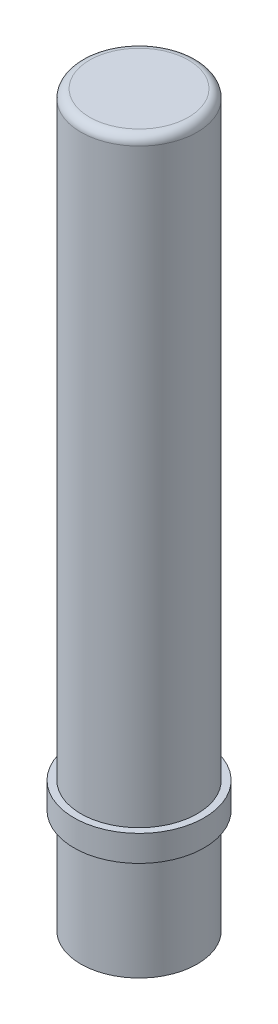
ISO-10303-21;
HEADER;
FILE_DESCRIPTION(('STEP AP214'),'2;1');
FILE_NAME('part.step','',(''),(''),'','','');
FILE_SCHEMA(('AUTOMOTIVE_DESIGN { 1 0 10303 214 1 1 1 1 }'));
ENDSEC;
DATA;
#1=APPLICATION_CONTEXT('core data for automotive mechanical design processes');
#2=APPLICATION_PROTOCOL_DEFINITION('international standard','automotive_design',2000,#1);
#3=PRODUCT_CONTEXT('',#1,'mechanical');
#4=PRODUCT('Part','Part','',(#3));
#5=PRODUCT_RELATED_PRODUCT_CATEGORY('part','',(#4));
#6=PRODUCT_DEFINITION_FORMATION('','',#4);
#7=PRODUCT_DEFINITION_CONTEXT('part definition',#1,'design');
#8=PRODUCT_DEFINITION('design','',#6,#7);
#9=PRODUCT_DEFINITION_SHAPE('','',#8);
#10=(LENGTH_UNIT() NAMED_UNIT(*) SI_UNIT(.MILLI.,.METRE.));
#11=(NAMED_UNIT(*) PLANE_ANGLE_UNIT() SI_UNIT($,.RADIAN.));
#12=(NAMED_UNIT(*) SI_UNIT($,.STERADIAN.) SOLID_ANGLE_UNIT());
#13=UNCERTAINTY_MEASURE_WITH_UNIT(LENGTH_MEASURE(1.E-05),#10,'distance_accuracy_value','');
#14=(GEOMETRIC_REPRESENTATION_CONTEXT(3) GLOBAL_UNCERTAINTY_ASSIGNED_CONTEXT((#13)) GLOBAL_UNIT_ASSIGNED_CONTEXT((#10,
#11,#12)) REPRESENTATION_CONTEXT('',''));
#15=CARTESIAN_POINT('',(0.,0.,0.));
#16=DIRECTION('',(0.,0.,1.));
#17=DIRECTION('',(1.,0.,0.));
#18=AXIS2_PLACEMENT_3D('',#15,#16,#17);
#19=CARTESIAN_POINT('',(0.,42.,0.));
#20=DIRECTION('',(0.,-1.,0.));
#21=DIRECTION('',(0.,0.,-1.));
#22=AXIS2_PLACEMENT_3D('',#19,#20,#21);
#23=CYLINDRICAL_SURFACE('',#22,3.35);
#24=CARTESIAN_POINT('',(0.,41.5,0.));
#25=DIRECTION('',(0.,1.,0.));
#26=DIRECTION('',(0.,0.,1.));
#27=AXIS2_PLACEMENT_3D('',#24,#25,#26);
#28=CIRCLE('',#27,3.35);
#29=CARTESIAN_POINT('',(0.,41.5,3.35));
#30=VERTEX_POINT('',#29);
#31=EDGE_CURVE('E10',#30,#30,#28,.F.);
#32=ORIENTED_EDGE('',*,*,#31,.T.);
#33=EDGE_LOOP('',(#32));
#34=FACE_BOUND('',#33,.T.);
#35=CARTESIAN_POINT('',(0.,7.5,0.));
#36=DIRECTION('',(0.,-1.,0.));
#37=DIRECTION('',(0.,0.,-1.));
#38=AXIS2_PLACEMENT_3D('',#35,#36,#37);
#39=CIRCLE('',#38,3.35);
#40=CARTESIAN_POINT('',(0.,7.5,-3.35));
#41=VERTEX_POINT('',#40);
#42=EDGE_CURVE('E46',#41,#41,#39,.T.);
#43=ORIENTED_EDGE('',*,*,#42,.F.);
#44=EDGE_LOOP('',(#43));
#45=FACE_BOUND('',#44,.T.);
#46=ADVANCED_FACE('F35',(#34,#45),#23,.T.);
#47=CARTESIAN_POINT('',(0.,42.,0.));
#48=DIRECTION('',(0.,1.,0.));
#49=DIRECTION('',(0.,0.,1.));
#50=AXIS2_PLACEMENT_3D('',#47,#48,#49);
#51=PLANE('',#50);
#52=CARTESIAN_POINT('',(0.,42.,0.));
#53=DIRECTION('',(0.,1.,0.));
#54=DIRECTION('',(0.,0.,1.));
#55=AXIS2_PLACEMENT_3D('',#52,#53,#54);
#56=CIRCLE('',#55,2.85);
#57=CARTESIAN_POINT('',(0.,42.,2.85));
#58=VERTEX_POINT('',#57);
#59=EDGE_CURVE('E42',#58,#58,#56,.T.);
#60=ORIENTED_EDGE('',*,*,#59,.T.);
#61=EDGE_LOOP('',(#60));
#62=FACE_BOUND('',#61,.T.);
#63=ADVANCED_FACE('F80',(#62),#51,.T.);
#64=CARTESIAN_POINT('',(0.,7.5,0.));
#65=DIRECTION('',(0.,-1.,0.));
#66=DIRECTION('',(0.,0.,-1.));
#67=AXIS2_PLACEMENT_3D('',#64,#65,#66);
#68=CYLINDRICAL_SURFACE('',#67,3.75);
#69=CARTESIAN_POINT('',(0.,7.5,0.));
#70=DIRECTION('',(0.,-1.,0.));
#71=DIRECTION('',(0.,0.,-1.));
#72=AXIS2_PLACEMENT_3D('',#69,#70,#71);
#73=CIRCLE('',#72,3.75);
#74=CARTESIAN_POINT('',(0.,7.5,-3.75));
#75=VERTEX_POINT('',#74);
#76=EDGE_CURVE('E56',#75,#75,#73,.T.);
#77=ORIENTED_EDGE('',*,*,#76,.T.);
#78=EDGE_LOOP('',(#77));
#79=FACE_BOUND('',#78,.T.);
#80=CARTESIAN_POINT('',(0.,6.,0.));
#81=DIRECTION('',(0.,-1.,0.));
#82=DIRECTION('',(0.,0.,-1.));
#83=AXIS2_PLACEMENT_3D('',#80,#81,#82);
#84=CIRCLE('',#83,3.75);
#85=CARTESIAN_POINT('',(0.,6.,-3.75));
#86=VERTEX_POINT('',#85);
#87=EDGE_CURVE('E59',#86,#86,#84,.T.);
#88=ORIENTED_EDGE('',*,*,#87,.F.);
#89=EDGE_LOOP('',(#88));
#90=FACE_BOUND('',#89,.T.);
#91=ADVANCED_FACE('F65',(#79,#90),#68,.T.);
#92=CARTESIAN_POINT('',(0.,7.5,0.));
#93=DIRECTION('',(0.,-1.,0.));
#94=DIRECTION('',(0.,0.,-1.));
#95=AXIS2_PLACEMENT_3D('',#92,#93,#94);
#96=PLANE('',#95);
#97=ORIENTED_EDGE('',*,*,#42,.T.);
#98=EDGE_LOOP('',(#97));
#99=FACE_BOUND('',#98,.T.);
#100=ORIENTED_EDGE('',*,*,#76,.F.);
#101=EDGE_LOOP('',(#100));
#102=FACE_BOUND('',#101,.T.);
#103=ADVANCED_FACE('F68',(#99,#102),#96,.F.);
#104=CARTESIAN_POINT('',(0.,6.,0.));
#105=DIRECTION('',(0.,-1.,0.));
#106=DIRECTION('',(0.,0.,-1.));
#107=AXIS2_PLACEMENT_3D('',#104,#105,#106);
#108=PLANE('',#107);
#109=CARTESIAN_POINT('',(0.,6.,0.));
#110=DIRECTION('',(0.,-1.,0.));
#111=DIRECTION('',(0.,0.,-1.));
#112=AXIS2_PLACEMENT_3D('',#109,#110,#111);
#113=CIRCLE('',#112,3.35);
#114=CARTESIAN_POINT('',(0.,6.,-3.35));
#115=VERTEX_POINT('',#114);
#116=EDGE_CURVE('E53',#115,#115,#113,.T.);
#117=ORIENTED_EDGE('',*,*,#116,.F.);
#118=EDGE_LOOP('',(#117));
#119=FACE_BOUND('',#118,.T.);
#120=ORIENTED_EDGE('',*,*,#87,.T.);
#121=EDGE_LOOP('',(#120));
#122=FACE_BOUND('',#121,.T.);
#123=ADVANCED_FACE('F70',(#119,#122),#108,.T.);
#124=CARTESIAN_POINT('',(0.,0.,0.));
#125=DIRECTION('',(0.,1.,0.));
#126=DIRECTION('',(0.,0.,1.));
#127=AXIS2_PLACEMENT_3D('',#124,#125,#126);
#128=PLANE('',#127);
#129=CARTESIAN_POINT('',(0.,0.,0.));
#130=DIRECTION('',(0.,1.,0.));
#131=DIRECTION('',(0.,0.,1.));
#132=AXIS2_PLACEMENT_3D('',#129,#130,#131);
#133=CIRCLE('',#132,3.35);
#134=CARTESIAN_POINT('',(0.,0.,3.35));
#135=VERTEX_POINT('',#134);
#136=EDGE_CURVE('E50',#135,#135,#133,.T.);
#137=ORIENTED_EDGE('',*,*,#136,.F.);
#138=EDGE_LOOP('',(#137));
#139=FACE_BOUND('',#138,.T.);
#140=ADVANCED_FACE('F77',(#139),#128,.F.);
#141=ORIENTED_EDGE('',*,*,#116,.T.);
#142=EDGE_LOOP('',(#141));
#143=FACE_BOUND('',#142,.T.);
#144=ORIENTED_EDGE('',*,*,#136,.T.);
#145=EDGE_LOOP('',(#144));
#146=FACE_BOUND('',#145,.T.);
#147=ADVANCED_FACE('F83',(#143,#146),#23,.T.);
#148=CARTESIAN_POINT('',(0.,41.5,0.));
#149=DIRECTION('',(0.,1.,0.));
#150=DIRECTION('',(0.,0.,1.));
#151=AXIS2_PLACEMENT_3D('',#148,#149,#150);
#152=TOROIDAL_SURFACE('',#151,2.85,0.5);
#153=ORIENTED_EDGE('',*,*,#31,.F.);
#154=EDGE_LOOP('',(#153));
#155=FACE_BOUND('',#154,.T.);
#156=ORIENTED_EDGE('',*,*,#59,.F.);
#157=EDGE_LOOP('',(#156));
#158=FACE_BOUND('',#157,.T.);
#159=ADVANCED_FACE('F37',(#155,#158),#152,.T.);
#160=CLOSED_SHELL('',(#46,#63,#91,#103,#123,#140,#147,#159));
#161=MANIFOLD_SOLID_BREP('B2',#160);
#162=ADVANCED_BREP_SHAPE_REPRESENTATION('',(#18,#161),#14);
#163=SHAPE_DEFINITION_REPRESENTATION(#9,#162);
ENDSEC;
END-ISO-10303-21;
